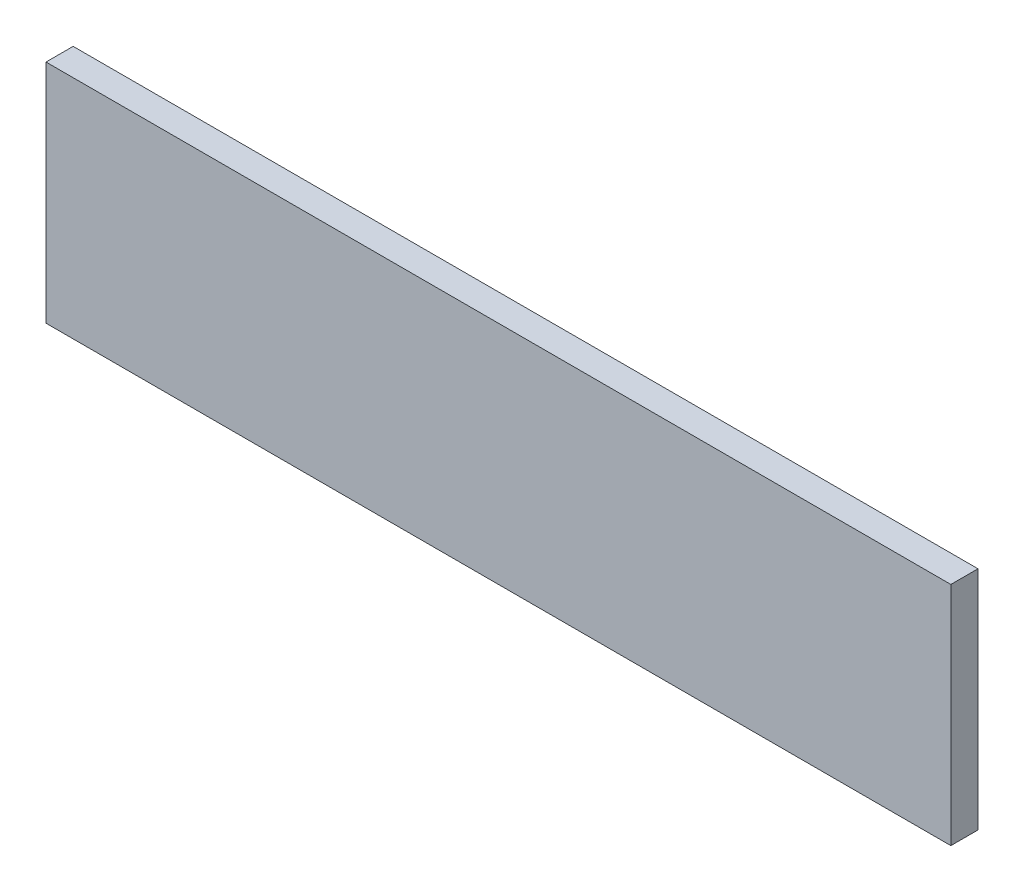
ISO-10303-21;
HEADER;
FILE_DESCRIPTION(('STEP AP214'),'2;1');
FILE_NAME('part.step','',(''),(''),'','','');
FILE_SCHEMA(('AUTOMOTIVE_DESIGN { 1 0 10303 214 1 1 1 1 }'));
ENDSEC;
DATA;
#1=APPLICATION_CONTEXT('core data for automotive mechanical design processes');
#2=APPLICATION_PROTOCOL_DEFINITION('international standard','automotive_design',2000,#1);
#3=PRODUCT_CONTEXT('',#1,'mechanical');
#4=PRODUCT('Part','Part','',(#3));
#5=PRODUCT_RELATED_PRODUCT_CATEGORY('part','',(#4));
#6=PRODUCT_DEFINITION_FORMATION('','',#4);
#7=PRODUCT_DEFINITION_CONTEXT('part definition',#1,'design');
#8=PRODUCT_DEFINITION('design','',#6,#7);
#9=PRODUCT_DEFINITION_SHAPE('','',#8);
#10=(LENGTH_UNIT() NAMED_UNIT(*) SI_UNIT(.MILLI.,.METRE.));
#11=(NAMED_UNIT(*) PLANE_ANGLE_UNIT() SI_UNIT($,.RADIAN.));
#12=(NAMED_UNIT(*) SI_UNIT($,.STERADIAN.) SOLID_ANGLE_UNIT());
#13=UNCERTAINTY_MEASURE_WITH_UNIT(LENGTH_MEASURE(1.E-05),#10,'distance_accuracy_value','');
#14=(GEOMETRIC_REPRESENTATION_CONTEXT(3) GLOBAL_UNCERTAINTY_ASSIGNED_CONTEXT((#13)) GLOBAL_UNIT_ASSIGNED_CONTEXT((#10,
#11,#12)) REPRESENTATION_CONTEXT('',''));
#15=CARTESIAN_POINT('',(0.,0.,0.));
#16=DIRECTION('',(0.,0.,1.));
#17=DIRECTION('',(1.,0.,0.));
#18=AXIS2_PLACEMENT_3D('',#15,#16,#17);
#19=CARTESIAN_POINT('',(-63.3587786259542,52.7989821882952,3.));
#20=DIRECTION('',(1.,0.,0.));
#21=DIRECTION('',(0.,1.,0.));
#22=AXIS2_PLACEMENT_3D('',#19,#20,#21);
#23=PLANE('',#22);
#24=DIRECTION('',(0.,-1.,0.));
#25=VECTOR('',#24,1.);
#26=CARTESIAN_POINT('',(-63.3587786259542,52.7989821882952,0.));
#27=LINE('',#26,#25);
#28=CARTESIAN_POINT('',(-63.3587786259542,52.7989821882952,0.));
#29=VERTEX_POINT('',#28);
#30=CARTESIAN_POINT('',(-63.3587786259542,27.7989821882952,0.));
#31=VERTEX_POINT('',#30);
#32=EDGE_CURVE('E98',#29,#31,#27,.T.);
#33=ORIENTED_EDGE('',*,*,#32,.T.);
#34=DIRECTION('',(0.,0.,-1.));
#35=VECTOR('',#34,1.);
#36=CARTESIAN_POINT('',(-63.3587786259542,27.7989821882952,3.));
#37=LINE('',#36,#35);
#38=CARTESIAN_POINT('',(-63.3587786259542,27.7989821882952,3.));
#39=VERTEX_POINT('',#38);
#40=EDGE_CURVE('E11',#39,#31,#37,.T.);
#41=ORIENTED_EDGE('',*,*,#40,.F.);
#42=DIRECTION('',(0.,-1.,0.));
#43=VECTOR('',#42,1.);
#44=CARTESIAN_POINT('',(-63.3587786259542,52.7989821882952,3.));
#45=LINE('',#44,#43);
#46=CARTESIAN_POINT('',(-63.3587786259542,52.7989821882952,3.));
#47=VERTEX_POINT('',#46);
#48=EDGE_CURVE('E86',#47,#39,#45,.T.);
#49=ORIENTED_EDGE('',*,*,#48,.F.);
#50=DIRECTION('',(0.,0.,-1.));
#51=VECTOR('',#50,1.);
#52=CARTESIAN_POINT('',(-63.3587786259542,52.7989821882952,3.));
#53=LINE('',#52,#51);
#54=EDGE_CURVE('E94',#47,#29,#53,.T.);
#55=ORIENTED_EDGE('',*,*,#54,.T.);
#56=EDGE_LOOP('',(#33,#41,#49,#55));
#57=FACE_BOUND('',#56,.T.);
#58=ADVANCED_FACE('F35',(#57),#23,.F.);
#59=CARTESIAN_POINT('',(-63.3587786259542,27.7989821882952,3.));
#60=DIRECTION('',(0.,1.,0.));
#61=DIRECTION('',(0.,0.,1.));
#62=AXIS2_PLACEMENT_3D('',#59,#60,#61);
#63=PLANE('',#62);
#64=DIRECTION('',(1.,0.,0.));
#65=VECTOR('',#64,1.);
#66=CARTESIAN_POINT('',(-63.3587786259542,27.7989821882952,0.));
#67=LINE('',#66,#65);
#68=CARTESIAN_POINT('',(36.6412213740458,27.7989821882952,0.));
#69=VERTEX_POINT('',#68);
#70=EDGE_CURVE('E90',#31,#69,#67,.T.);
#71=ORIENTED_EDGE('',*,*,#70,.T.);
#72=DIRECTION('',(0.,0.,-1.));
#73=VECTOR('',#72,1.);
#74=CARTESIAN_POINT('',(36.6412213740458,27.7989821882952,3.));
#75=LINE('',#74,#73);
#76=CARTESIAN_POINT('',(36.6412213740458,27.7989821882952,3.));
#77=VERTEX_POINT('',#76);
#78=EDGE_CURVE('E43',#77,#69,#75,.T.);
#79=ORIENTED_EDGE('',*,*,#78,.F.);
#80=DIRECTION('',(1.,0.,0.));
#81=VECTOR('',#80,1.);
#82=CARTESIAN_POINT('',(-63.3587786259542,27.7989821882952,3.));
#83=LINE('',#82,#81);
#84=EDGE_CURVE('E81',#39,#77,#83,.T.);
#85=ORIENTED_EDGE('',*,*,#84,.F.);
#86=ORIENTED_EDGE('',*,*,#40,.T.);
#87=EDGE_LOOP('',(#71,#79,#85,#86));
#88=FACE_BOUND('',#87,.T.);
#89=ADVANCED_FACE('F89',(#88),#63,.F.);
#90=CARTESIAN_POINT('',(36.6412213740458,52.7989821882952,3.));
#91=DIRECTION('',(-1.,0.,0.));
#92=DIRECTION('',(0.,0.,1.));
#93=AXIS2_PLACEMENT_3D('',#90,#91,#92);
#94=PLANE('',#93);
#95=DIRECTION('',(0.,1.,0.));
#96=VECTOR('',#95,1.);
#97=CARTESIAN_POINT('',(36.6412213740458,52.7989821882952,0.));
#98=LINE('',#97,#96);
#99=CARTESIAN_POINT('',(36.6412213740458,52.7989821882952,0.));
#100=VERTEX_POINT('',#99);
#101=EDGE_CURVE('E68',#69,#100,#98,.T.);
#102=ORIENTED_EDGE('',*,*,#101,.T.);
#103=DIRECTION('',(0.,0.,-1.));
#104=VECTOR('',#103,1.);
#105=CARTESIAN_POINT('',(36.6412213740458,52.7989821882952,3.));
#106=LINE('',#105,#104);
#107=CARTESIAN_POINT('',(36.6412213740458,52.7989821882952,3.));
#108=VERTEX_POINT('',#107);
#109=EDGE_CURVE('E91',#108,#100,#106,.T.);
#110=ORIENTED_EDGE('',*,*,#109,.F.);
#111=DIRECTION('',(0.,1.,0.));
#112=VECTOR('',#111,1.);
#113=CARTESIAN_POINT('',(36.6412213740458,52.7989821882952,3.));
#114=LINE('',#113,#112);
#115=EDGE_CURVE('E84',#77,#108,#114,.T.);
#116=ORIENTED_EDGE('',*,*,#115,.F.);
#117=ORIENTED_EDGE('',*,*,#78,.T.);
#118=EDGE_LOOP('',(#102,#110,#116,#117));
#119=FACE_BOUND('',#118,.T.);
#120=ADVANCED_FACE('F92',(#119),#94,.F.);
#121=CARTESIAN_POINT('',(-63.3587786259542,52.7989821882952,3.));
#122=DIRECTION('',(0.,-1.,0.));
#123=DIRECTION('',(0.,0.,-1.));
#124=AXIS2_PLACEMENT_3D('',#121,#122,#123);
#125=PLANE('',#124);
#126=DIRECTION('',(-1.,0.,0.));
#127=VECTOR('',#126,1.);
#128=CARTESIAN_POINT('',(-63.3587786259542,52.7989821882952,0.));
#129=LINE('',#128,#127);
#130=EDGE_CURVE('E74',#100,#29,#129,.T.);
#131=ORIENTED_EDGE('',*,*,#130,.T.);
#132=ORIENTED_EDGE('',*,*,#54,.F.);
#133=DIRECTION('',(-1.,0.,0.));
#134=VECTOR('',#133,1.);
#135=CARTESIAN_POINT('',(-63.3587786259542,52.7989821882952,3.));
#136=LINE('',#135,#134);
#137=EDGE_CURVE('E51',#108,#47,#136,.T.);
#138=ORIENTED_EDGE('',*,*,#137,.F.);
#139=ORIENTED_EDGE('',*,*,#109,.T.);
#140=EDGE_LOOP('',(#131,#132,#138,#139));
#141=FACE_BOUND('',#140,.T.);
#142=ADVANCED_FACE('F105',(#141),#125,.F.);
#143=CARTESIAN_POINT('',(0.,0.,3.));
#144=DIRECTION('',(0.,0.,1.));
#145=DIRECTION('',(1.,0.,0.));
#146=AXIS2_PLACEMENT_3D('',#143,#144,#145);
#147=PLANE('',#146);
#148=ORIENTED_EDGE('',*,*,#48,.T.);
#149=ORIENTED_EDGE('',*,*,#84,.T.);
#150=ORIENTED_EDGE('',*,*,#115,.T.);
#151=ORIENTED_EDGE('',*,*,#137,.T.);
#152=EDGE_LOOP('',(#148,#149,#150,#151));
#153=FACE_BOUND('',#152,.T.);
#154=ADVANCED_FACE('F82',(#153),#147,.T.);
#155=CARTESIAN_POINT('',(0.,0.,0.));
#156=DIRECTION('',(0.,0.,1.));
#157=DIRECTION('',(1.,0.,0.));
#158=AXIS2_PLACEMENT_3D('',#155,#156,#157);
#159=PLANE('',#158);
#160=ORIENTED_EDGE('',*,*,#32,.F.);
#161=ORIENTED_EDGE('',*,*,#130,.F.);
#162=ORIENTED_EDGE('',*,*,#101,.F.);
#163=ORIENTED_EDGE('',*,*,#70,.F.);
#164=EDGE_LOOP('',(#160,#161,#162,#163));
#165=FACE_BOUND('',#164,.T.);
#166=ADVANCED_FACE('F108',(#165),#159,.F.);
#167=CLOSED_SHELL('',(#58,#89,#120,#142,#154,#166));
#168=MANIFOLD_SOLID_BREP('B2',#167);
#169=ADVANCED_BREP_SHAPE_REPRESENTATION('',(#18,#168),#14);
#170=SHAPE_DEFINITION_REPRESENTATION(#9,#169);
ENDSEC;
END-ISO-10303-21;
